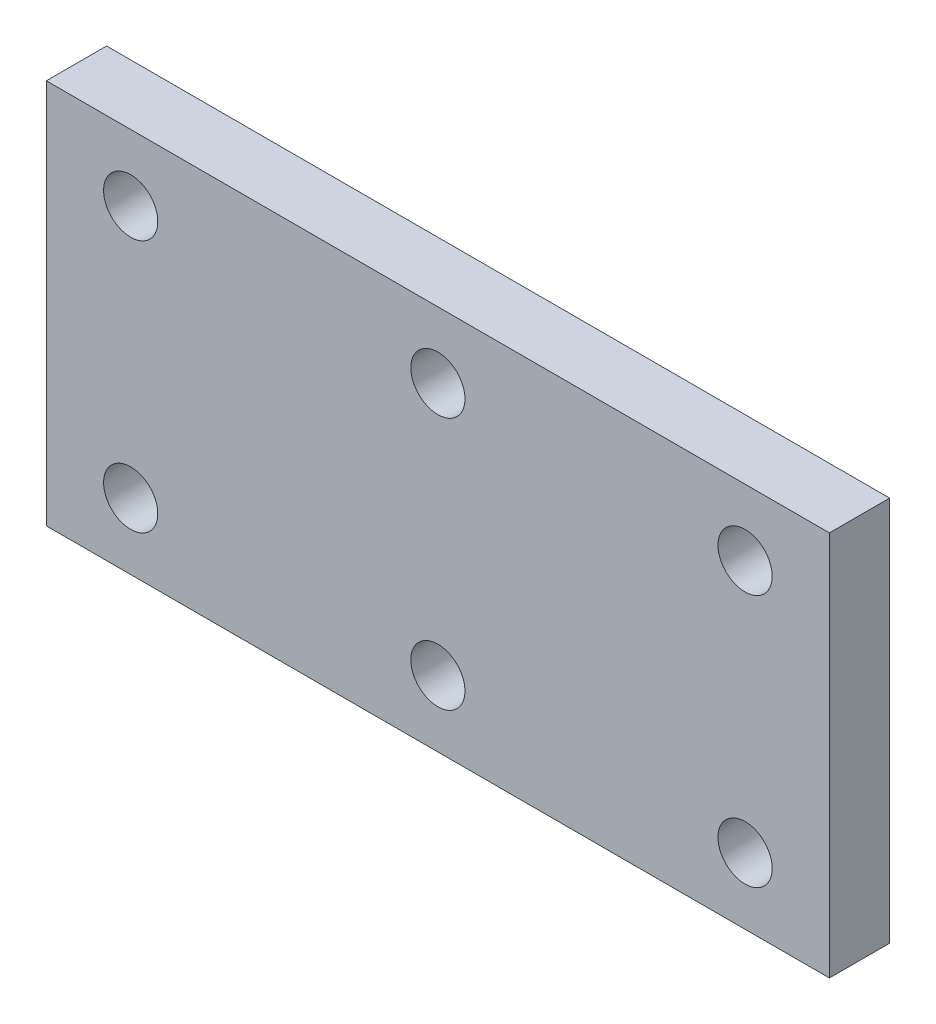
ISO-10303-21;
HEADER;
FILE_DESCRIPTION(('STEP AP214'),'2;1');
FILE_NAME('part.step','',(''),(''),'','','');
FILE_SCHEMA(('AUTOMOTIVE_DESIGN { 1 0 10303 214 1 1 1 1 }'));
ENDSEC;
DATA;
#1=APPLICATION_CONTEXT('core data for automotive mechanical design processes');
#2=APPLICATION_PROTOCOL_DEFINITION('international standard','automotive_design',2000,#1);
#3=PRODUCT_CONTEXT('',#1,'mechanical');
#4=PRODUCT('Part','Part','',(#3));
#5=PRODUCT_RELATED_PRODUCT_CATEGORY('part','',(#4));
#6=PRODUCT_DEFINITION_FORMATION('','',#4);
#7=PRODUCT_DEFINITION_CONTEXT('part definition',#1,'design');
#8=PRODUCT_DEFINITION('design','',#6,#7);
#9=PRODUCT_DEFINITION_SHAPE('','',#8);
#10=(LENGTH_UNIT() NAMED_UNIT(*) SI_UNIT(.MILLI.,.METRE.));
#11=(NAMED_UNIT(*) PLANE_ANGLE_UNIT() SI_UNIT($,.RADIAN.));
#12=(NAMED_UNIT(*) SI_UNIT($,.STERADIAN.) SOLID_ANGLE_UNIT());
#13=UNCERTAINTY_MEASURE_WITH_UNIT(LENGTH_MEASURE(1.E-05),#10,'distance_accuracy_value','');
#14=(GEOMETRIC_REPRESENTATION_CONTEXT(3) GLOBAL_UNCERTAINTY_ASSIGNED_CONTEXT((#13)) GLOBAL_UNIT_ASSIGNED_CONTEXT((#10,
#11,#12)) REPRESENTATION_CONTEXT('',''));
#15=CARTESIAN_POINT('',(0.,0.,0.));
#16=DIRECTION('',(0.,0.,1.));
#17=DIRECTION('',(1.,0.,0.));
#18=AXIS2_PLACEMENT_3D('',#15,#16,#17);
#19=CARTESIAN_POINT('',(0.,0.,0.));
#20=DIRECTION('',(0.,0.,1.));
#21=DIRECTION('',(1.,0.,0.));
#22=AXIS2_PLACEMENT_3D('',#19,#20,#21);
#23=PLANE('',#22);
#24=CARTESIAN_POINT('',(-25.5,10.5,0.));
#25=DIRECTION('',(0.,0.,-1.));
#26=DIRECTION('',(-1.,0.,0.));
#27=AXIS2_PLACEMENT_3D('',#24,#25,#26);
#28=CIRCLE('',#27,2.25);
#29=CARTESIAN_POINT('',(-27.75,10.5,0.));
#30=VERTEX_POINT('',#29);
#31=EDGE_CURVE('E96',#30,#30,#28,.F.);
#32=ORIENTED_EDGE('',*,*,#31,.T.);
#33=EDGE_LOOP('',(#32));
#34=FACE_BOUND('',#33,.T.);
#35=CARTESIAN_POINT('',(-25.5,-10.5,0.));
#36=DIRECTION('',(0.,0.,-1.));
#37=DIRECTION('',(-1.,0.,0.));
#38=AXIS2_PLACEMENT_3D('',#35,#36,#37);
#39=CIRCLE('',#38,2.25);
#40=CARTESIAN_POINT('',(-27.75,-10.5,0.));
#41=VERTEX_POINT('',#40);
#42=EDGE_CURVE('E100',#41,#41,#39,.F.);
#43=ORIENTED_EDGE('',*,*,#42,.T.);
#44=EDGE_LOOP('',(#43));
#45=FACE_BOUND('',#44,.T.);
#46=CARTESIAN_POINT('',(0.,10.5,0.));
#47=DIRECTION('',(0.,0.,-1.));
#48=DIRECTION('',(-1.,0.,0.));
#49=AXIS2_PLACEMENT_3D('',#46,#47,#48);
#50=CIRCLE('',#49,2.25);
#51=CARTESIAN_POINT('',(-2.25,10.5,0.));
#52=VERTEX_POINT('',#51);
#53=EDGE_CURVE('E103',#52,#52,#50,.F.);
#54=ORIENTED_EDGE('',*,*,#53,.T.);
#55=EDGE_LOOP('',(#54));
#56=FACE_BOUND('',#55,.T.);
#57=CARTESIAN_POINT('',(0.,-10.5,0.));
#58=DIRECTION('',(0.,0.,-1.));
#59=DIRECTION('',(-1.,0.,0.));
#60=AXIS2_PLACEMENT_3D('',#57,#58,#59);
#61=CIRCLE('',#60,2.25);
#62=CARTESIAN_POINT('',(-2.25,-10.5,0.));
#63=VERTEX_POINT('',#62);
#64=EDGE_CURVE('E106',#63,#63,#61,.F.);
#65=ORIENTED_EDGE('',*,*,#64,.T.);
#66=EDGE_LOOP('',(#65));
#67=FACE_BOUND('',#66,.T.);
#68=CARTESIAN_POINT('',(25.5,10.5,0.));
#69=DIRECTION('',(0.,0.,-1.));
#70=DIRECTION('',(-1.,0.,0.));
#71=AXIS2_PLACEMENT_3D('',#68,#69,#70);
#72=CIRCLE('',#71,2.25);
#73=CARTESIAN_POINT('',(23.25,10.5,0.));
#74=VERTEX_POINT('',#73);
#75=EDGE_CURVE('E108',#74,#74,#72,.F.);
#76=ORIENTED_EDGE('',*,*,#75,.T.);
#77=EDGE_LOOP('',(#76));
#78=FACE_BOUND('',#77,.T.);
#79=CARTESIAN_POINT('',(25.5,-10.5,0.));
#80=DIRECTION('',(0.,0.,-1.));
#81=DIRECTION('',(-1.,0.,0.));
#82=AXIS2_PLACEMENT_3D('',#79,#80,#81);
#83=CIRCLE('',#82,2.25);
#84=CARTESIAN_POINT('',(23.25,-10.5,0.));
#85=VERTEX_POINT('',#84);
#86=EDGE_CURVE('E20',#85,#85,#83,.F.);
#87=ORIENTED_EDGE('',*,*,#86,.T.);
#88=EDGE_LOOP('',(#87));
#89=FACE_BOUND('',#88,.T.);
#90=DIRECTION('',(0.,1.,0.));
#91=VECTOR('',#90,1.);
#92=CARTESIAN_POINT('',(-32.5,-16.,0.));
#93=LINE('',#92,#91);
#94=CARTESIAN_POINT('',(-32.5,16.,0.));
#95=VERTEX_POINT('',#94);
#96=CARTESIAN_POINT('',(-32.5,-16.,0.));
#97=VERTEX_POINT('',#96);
#98=EDGE_CURVE('E60',#95,#97,#93,.F.);
#99=ORIENTED_EDGE('',*,*,#98,.F.);
#100=DIRECTION('',(1.,0.,0.));
#101=VECTOR('',#100,1.);
#102=CARTESIAN_POINT('',(-32.5,16.,0.));
#103=LINE('',#102,#101);
#104=CARTESIAN_POINT('',(32.5,16.,0.));
#105=VERTEX_POINT('',#104);
#106=EDGE_CURVE('E115',#105,#95,#103,.F.);
#107=ORIENTED_EDGE('',*,*,#106,.F.);
#108=DIRECTION('',(0.,1.,0.));
#109=VECTOR('',#108,1.);
#110=CARTESIAN_POINT('',(32.5,16.,0.));
#111=LINE('',#110,#109);
#112=CARTESIAN_POINT('',(32.5,-16.,0.));
#113=VERTEX_POINT('',#112);
#114=EDGE_CURVE('E70',#113,#105,#111,.T.);
#115=ORIENTED_EDGE('',*,*,#114,.F.);
#116=DIRECTION('',(1.,0.,0.));
#117=VECTOR('',#116,1.);
#118=CARTESIAN_POINT('',(32.5,-16.,0.));
#119=LINE('',#118,#117);
#120=EDGE_CURVE('E55',#97,#113,#119,.T.);
#121=ORIENTED_EDGE('',*,*,#120,.F.);
#122=EDGE_LOOP('',(#99,#107,#115,#121));
#123=FACE_BOUND('',#122,.T.);
#124=ADVANCED_FACE('F17',(#34,#45,#56,#67,#78,#89,#123),#23,.F.);
#125=CARTESIAN_POINT('',(-32.5,-16.,0.));
#126=DIRECTION('',(-1.,0.,0.));
#127=DIRECTION('',(0.,0.,1.));
#128=AXIS2_PLACEMENT_3D('',#125,#126,#127);
#129=PLANE('',#128);
#130=ORIENTED_EDGE('',*,*,#98,.T.);
#131=DIRECTION('',(0.,0.,-1.));
#132=VECTOR('',#131,1.);
#133=CARTESIAN_POINT('',(-32.5,-16.,0.));
#134=LINE('',#133,#132);
#135=CARTESIAN_POINT('',(-32.5,-16.,5.));
#136=VERTEX_POINT('',#135);
#137=EDGE_CURVE('E62',#136,#97,#134,.T.);
#138=ORIENTED_EDGE('',*,*,#137,.F.);
#139=DIRECTION('',(0.,1.,0.));
#140=VECTOR('',#139,1.);
#141=CARTESIAN_POINT('',(-32.5,0.,5.));
#142=LINE('',#141,#140);
#143=CARTESIAN_POINT('',(-32.5,16.,5.));
#144=VERTEX_POINT('',#143);
#145=EDGE_CURVE('E99',#144,#136,#142,.F.);
#146=ORIENTED_EDGE('',*,*,#145,.F.);
#147=DIRECTION('',(0.,0.,1.));
#148=VECTOR('',#147,1.);
#149=CARTESIAN_POINT('',(-32.5,16.,0.));
#150=LINE('',#149,#148);
#151=EDGE_CURVE('E65',#95,#144,#150,.T.);
#152=ORIENTED_EDGE('',*,*,#151,.F.);
#153=EDGE_LOOP('',(#130,#138,#146,#152));
#154=FACE_BOUND('',#153,.T.);
#155=ADVANCED_FACE('F61',(#154),#129,.T.);
#156=CARTESIAN_POINT('',(32.5,-16.,0.));
#157=DIRECTION('',(0.,-1.,0.));
#158=DIRECTION('',(0.,0.,-1.));
#159=AXIS2_PLACEMENT_3D('',#156,#157,#158);
#160=PLANE('',#159);
#161=ORIENTED_EDGE('',*,*,#120,.T.);
#162=DIRECTION('',(0.,0.,-1.));
#163=VECTOR('',#162,1.);
#164=CARTESIAN_POINT('',(32.5,-16.,0.));
#165=LINE('',#164,#163);
#166=CARTESIAN_POINT('',(32.5,-16.,5.));
#167=VERTEX_POINT('',#166);
#168=EDGE_CURVE('E72',#167,#113,#165,.T.);
#169=ORIENTED_EDGE('',*,*,#168,.F.);
#170=DIRECTION('',(1.,0.,0.));
#171=VECTOR('',#170,1.);
#172=CARTESIAN_POINT('',(0.,-16.,5.));
#173=LINE('',#172,#171);
#174=EDGE_CURVE('E76',#136,#167,#173,.T.);
#175=ORIENTED_EDGE('',*,*,#174,.F.);
#176=ORIENTED_EDGE('',*,*,#137,.T.);
#177=EDGE_LOOP('',(#161,#169,#175,#176));
#178=FACE_BOUND('',#177,.T.);
#179=ADVANCED_FACE('F74',(#178),#160,.T.);
#180=CARTESIAN_POINT('',(32.5,16.,0.));
#181=DIRECTION('',(1.,0.,0.));
#182=DIRECTION('',(0.,0.,-1.));
#183=AXIS2_PLACEMENT_3D('',#180,#181,#182);
#184=PLANE('',#183);
#185=ORIENTED_EDGE('',*,*,#114,.T.);
#186=DIRECTION('',(0.,0.,1.));
#187=VECTOR('',#186,1.);
#188=CARTESIAN_POINT('',(32.5,16.,0.));
#189=LINE('',#188,#187);
#190=CARTESIAN_POINT('',(32.5,16.,5.));
#191=VERTEX_POINT('',#190);
#192=EDGE_CURVE('E35',#191,#105,#189,.F.);
#193=ORIENTED_EDGE('',*,*,#192,.F.);
#194=DIRECTION('',(0.,1.,0.));
#195=VECTOR('',#194,1.);
#196=CARTESIAN_POINT('',(32.5,0.,5.));
#197=LINE('',#196,#195);
#198=EDGE_CURVE('E126',#167,#191,#197,.T.);
#199=ORIENTED_EDGE('',*,*,#198,.F.);
#200=ORIENTED_EDGE('',*,*,#168,.T.);
#201=EDGE_LOOP('',(#185,#193,#199,#200));
#202=FACE_BOUND('',#201,.T.);
#203=ADVANCED_FACE('F124',(#202),#184,.T.);
#204=CARTESIAN_POINT('',(-32.5,16.,0.));
#205=DIRECTION('',(0.,1.,0.));
#206=DIRECTION('',(0.,0.,1.));
#207=AXIS2_PLACEMENT_3D('',#204,#205,#206);
#208=PLANE('',#207);
#209=ORIENTED_EDGE('',*,*,#106,.T.);
#210=ORIENTED_EDGE('',*,*,#151,.T.);
#211=DIRECTION('',(1.,0.,0.));
#212=VECTOR('',#211,1.);
#213=CARTESIAN_POINT('',(0.,16.,5.));
#214=LINE('',#213,#212);
#215=EDGE_CURVE('E95',#191,#144,#214,.F.);
#216=ORIENTED_EDGE('',*,*,#215,.F.);
#217=ORIENTED_EDGE('',*,*,#192,.T.);
#218=EDGE_LOOP('',(#209,#210,#216,#217));
#219=FACE_BOUND('',#218,.T.);
#220=ADVANCED_FACE('F131',(#219),#208,.T.);
#221=CARTESIAN_POINT('',(25.5,-10.5,0.));
#222=DIRECTION('',(0.,0.,-1.));
#223=DIRECTION('',(-1.,0.,0.));
#224=AXIS2_PLACEMENT_3D('',#221,#222,#223);
#225=CYLINDRICAL_SURFACE('',#224,2.25);
#226=ORIENTED_EDGE('',*,*,#86,.F.);
#227=EDGE_LOOP('',(#226));
#228=FACE_BOUND('',#227,.T.);
#229=CARTESIAN_POINT('',(25.5,-10.5,5.));
#230=DIRECTION('',(0.,0.,-1.));
#231=DIRECTION('',(-1.,0.,0.));
#232=AXIS2_PLACEMENT_3D('',#229,#230,#231);
#233=CIRCLE('',#232,2.25);
#234=CARTESIAN_POINT('',(23.25,-10.5,5.));
#235=VERTEX_POINT('',#234);
#236=EDGE_CURVE('E92',#235,#235,#233,.T.);
#237=ORIENTED_EDGE('',*,*,#236,.F.);
#238=EDGE_LOOP('',(#237));
#239=FACE_BOUND('',#238,.T.);
#240=ADVANCED_FACE('F133',(#228,#239),#225,.F.);
#241=CARTESIAN_POINT('',(25.5,10.5,0.));
#242=DIRECTION('',(0.,0.,-1.));
#243=DIRECTION('',(-1.,0.,0.));
#244=AXIS2_PLACEMENT_3D('',#241,#242,#243);
#245=CYLINDRICAL_SURFACE('',#244,2.25);
#246=ORIENTED_EDGE('',*,*,#75,.F.);
#247=EDGE_LOOP('',(#246));
#248=FACE_BOUND('',#247,.T.);
#249=CARTESIAN_POINT('',(25.5,10.5,5.));
#250=DIRECTION('',(0.,0.,-1.));
#251=DIRECTION('',(-1.,0.,0.));
#252=AXIS2_PLACEMENT_3D('',#249,#250,#251);
#253=CIRCLE('',#252,2.25);
#254=CARTESIAN_POINT('',(23.25,10.5,5.));
#255=VERTEX_POINT('',#254);
#256=EDGE_CURVE('E89',#255,#255,#253,.T.);
#257=ORIENTED_EDGE('',*,*,#256,.F.);
#258=EDGE_LOOP('',(#257));
#259=FACE_BOUND('',#258,.T.);
#260=ADVANCED_FACE('F140',(#248,#259),#245,.F.);
#261=CARTESIAN_POINT('',(0.,-10.5,0.));
#262=DIRECTION('',(0.,0.,-1.));
#263=DIRECTION('',(-1.,0.,0.));
#264=AXIS2_PLACEMENT_3D('',#261,#262,#263);
#265=CYLINDRICAL_SURFACE('',#264,2.25);
#266=ORIENTED_EDGE('',*,*,#64,.F.);
#267=EDGE_LOOP('',(#266));
#268=FACE_BOUND('',#267,.T.);
#269=CARTESIAN_POINT('',(0.,-10.5,5.));
#270=DIRECTION('',(0.,0.,-1.));
#271=DIRECTION('',(-1.,0.,0.));
#272=AXIS2_PLACEMENT_3D('',#269,#270,#271);
#273=CIRCLE('',#272,2.25);
#274=CARTESIAN_POINT('',(-2.25,-10.5,5.));
#275=VERTEX_POINT('',#274);
#276=EDGE_CURVE('E86',#275,#275,#273,.T.);
#277=ORIENTED_EDGE('',*,*,#276,.F.);
#278=EDGE_LOOP('',(#277));
#279=FACE_BOUND('',#278,.T.);
#280=ADVANCED_FACE('F162',(#268,#279),#265,.F.);
#281=CARTESIAN_POINT('',(0.,10.5,0.));
#282=DIRECTION('',(0.,0.,-1.));
#283=DIRECTION('',(-1.,0.,0.));
#284=AXIS2_PLACEMENT_3D('',#281,#282,#283);
#285=CYLINDRICAL_SURFACE('',#284,2.25);
#286=ORIENTED_EDGE('',*,*,#53,.F.);
#287=EDGE_LOOP('',(#286));
#288=FACE_BOUND('',#287,.T.);
#289=CARTESIAN_POINT('',(0.,10.5,5.));
#290=DIRECTION('',(0.,0.,-1.));
#291=DIRECTION('',(-1.,0.,0.));
#292=AXIS2_PLACEMENT_3D('',#289,#290,#291);
#293=CIRCLE('',#292,2.25);
#294=CARTESIAN_POINT('',(-2.25,10.5,5.));
#295=VERTEX_POINT('',#294);
#296=EDGE_CURVE('E83',#295,#295,#293,.T.);
#297=ORIENTED_EDGE('',*,*,#296,.F.);
#298=EDGE_LOOP('',(#297));
#299=FACE_BOUND('',#298,.T.);
#300=ADVANCED_FACE('F158',(#288,#299),#285,.F.);
#301=CARTESIAN_POINT('',(-25.5,-10.5,0.));
#302=DIRECTION('',(0.,0.,-1.));
#303=DIRECTION('',(-1.,0.,0.));
#304=AXIS2_PLACEMENT_3D('',#301,#302,#303);
#305=CYLINDRICAL_SURFACE('',#304,2.25);
#306=ORIENTED_EDGE('',*,*,#42,.F.);
#307=EDGE_LOOP('',(#306));
#308=FACE_BOUND('',#307,.T.);
#309=CARTESIAN_POINT('',(-25.5,-10.5,5.));
#310=DIRECTION('',(0.,0.,-1.));
#311=DIRECTION('',(-1.,0.,0.));
#312=AXIS2_PLACEMENT_3D('',#309,#310,#311);
#313=CIRCLE('',#312,2.25);
#314=CARTESIAN_POINT('',(-27.75,-10.5,5.));
#315=VERTEX_POINT('',#314);
#316=EDGE_CURVE('E26',#315,#315,#313,.T.);
#317=ORIENTED_EDGE('',*,*,#316,.F.);
#318=EDGE_LOOP('',(#317));
#319=FACE_BOUND('',#318,.T.);
#320=ADVANCED_FACE('F151',(#308,#319),#305,.F.);
#321=CARTESIAN_POINT('',(-25.5,10.5,0.));
#322=DIRECTION('',(0.,0.,-1.));
#323=DIRECTION('',(-1.,0.,0.));
#324=AXIS2_PLACEMENT_3D('',#321,#322,#323);
#325=CYLINDRICAL_SURFACE('',#324,2.25);
#326=ORIENTED_EDGE('',*,*,#31,.F.);
#327=EDGE_LOOP('',(#326));
#328=FACE_BOUND('',#327,.T.);
#329=CARTESIAN_POINT('',(-25.5,10.5,5.));
#330=DIRECTION('',(0.,0.,-1.));
#331=DIRECTION('',(-1.,0.,0.));
#332=AXIS2_PLACEMENT_3D('',#329,#330,#331);
#333=CIRCLE('',#332,2.25);
#334=CARTESIAN_POINT('',(-27.75,10.5,5.));
#335=VERTEX_POINT('',#334);
#336=EDGE_CURVE('E11',#335,#335,#333,.T.);
#337=ORIENTED_EDGE('',*,*,#336,.F.);
#338=EDGE_LOOP('',(#337));
#339=FACE_BOUND('',#338,.T.);
#340=ADVANCED_FACE('F145',(#328,#339),#325,.F.);
#341=CARTESIAN_POINT('',(0.,0.,5.));
#342=DIRECTION('',(0.,0.,1.));
#343=DIRECTION('',(1.,0.,0.));
#344=AXIS2_PLACEMENT_3D('',#341,#342,#343);
#345=PLANE('',#344);
#346=ORIENTED_EDGE('',*,*,#336,.T.);
#347=EDGE_LOOP('',(#346));
#348=FACE_BOUND('',#347,.T.);
#349=ORIENTED_EDGE('',*,*,#316,.T.);
#350=EDGE_LOOP('',(#349));
#351=FACE_BOUND('',#350,.T.);
#352=ORIENTED_EDGE('',*,*,#296,.T.);
#353=EDGE_LOOP('',(#352));
#354=FACE_BOUND('',#353,.T.);
#355=ORIENTED_EDGE('',*,*,#276,.T.);
#356=EDGE_LOOP('',(#355));
#357=FACE_BOUND('',#356,.T.);
#358=ORIENTED_EDGE('',*,*,#256,.T.);
#359=EDGE_LOOP('',(#358));
#360=FACE_BOUND('',#359,.T.);
#361=ORIENTED_EDGE('',*,*,#236,.T.);
#362=EDGE_LOOP('',(#361));
#363=FACE_BOUND('',#362,.T.);
#364=ORIENTED_EDGE('',*,*,#198,.T.);
#365=ORIENTED_EDGE('',*,*,#215,.T.);
#366=ORIENTED_EDGE('',*,*,#145,.T.);
#367=ORIENTED_EDGE('',*,*,#174,.T.);
#368=EDGE_LOOP('',(#364,#365,#366,#367));
#369=FACE_BOUND('',#368,.T.);
#370=ADVANCED_FACE('F129',(#348,#351,#354,#357,#360,#363,#369),#345,.T.);
#371=CLOSED_SHELL('',(#124,#155,#179,#203,#220,#240,#260,#280,#300,#320,#340,#370));
#372=MANIFOLD_SOLID_BREP('B1',#371);
#373=ADVANCED_BREP_SHAPE_REPRESENTATION('',(#18,#372),#14);
#374=SHAPE_DEFINITION_REPRESENTATION(#9,#373);
ENDSEC;
END-ISO-10303-21;
